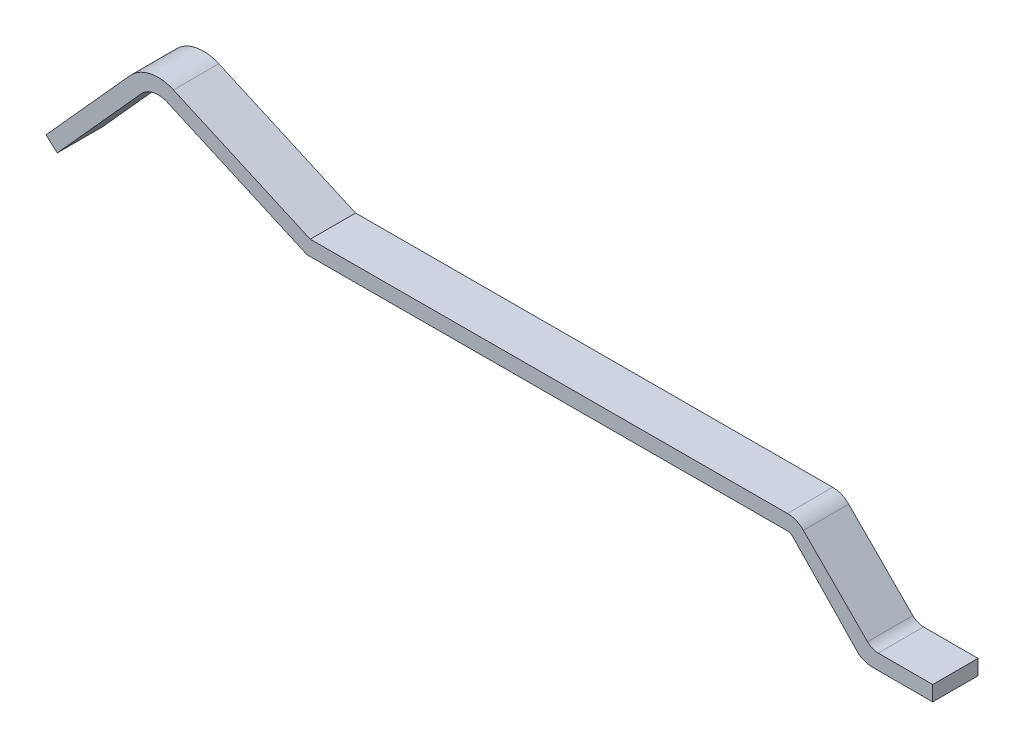
ISO-10303-21;
HEADER;
FILE_DESCRIPTION(('STEP AP214'),'2;1');
FILE_NAME('part.step','',(''),(''),'','','');
FILE_SCHEMA(('AUTOMOTIVE_DESIGN { 1 0 10303 214 1 1 1 1 }'));
ENDSEC;
DATA;
#1=APPLICATION_CONTEXT('core data for automotive mechanical design processes');
#2=APPLICATION_PROTOCOL_DEFINITION('international standard','automotive_design',2000,#1);
#3=PRODUCT_CONTEXT('',#1,'mechanical');
#4=PRODUCT('Part','Part','',(#3));
#5=PRODUCT_RELATED_PRODUCT_CATEGORY('part','',(#4));
#6=PRODUCT_DEFINITION_FORMATION('','',#4);
#7=PRODUCT_DEFINITION_CONTEXT('part definition',#1,'design');
#8=PRODUCT_DEFINITION('design','',#6,#7);
#9=PRODUCT_DEFINITION_SHAPE('','',#8);
#10=(LENGTH_UNIT() NAMED_UNIT(*) SI_UNIT(.MILLI.,.METRE.));
#11=(NAMED_UNIT(*) PLANE_ANGLE_UNIT() SI_UNIT($,.RADIAN.));
#12=(NAMED_UNIT(*) SI_UNIT($,.STERADIAN.) SOLID_ANGLE_UNIT());
#13=UNCERTAINTY_MEASURE_WITH_UNIT(LENGTH_MEASURE(1.E-05),#10,'distance_accuracy_value','');
#14=(GEOMETRIC_REPRESENTATION_CONTEXT(3) GLOBAL_UNCERTAINTY_ASSIGNED_CONTEXT((#13)) GLOBAL_UNIT_ASSIGNED_CONTEXT((#10,
#11,#12)) REPRESENTATION_CONTEXT('',''));
#15=CARTESIAN_POINT('',(0.,0.,0.));
#16=DIRECTION('',(0.,0.,1.));
#17=DIRECTION('',(1.,0.,0.));
#18=AXIS2_PLACEMENT_3D('',#15,#16,#17);
#19=CARTESIAN_POINT('',(19.9707476581065,0.204274436581358,0.3));
#20=DIRECTION('',(0.,-1.,0.));
#21=DIRECTION('',(1.,0.,0.));
#22=AXIS2_PLACEMENT_3D('',#19,#20,#21);
#23=PLANE('',#22);
#24=DIRECTION('',(-1.,0.,0.));
#25=VECTOR('',#24,1.);
#26=CARTESIAN_POINT('',(19.9707476581065,0.204274436581358,-0.3));
#27=LINE('',#26,#25);
#28=CARTESIAN_POINT('',(20.6917527563786,0.204274436581358,-0.3));
#29=VERTEX_POINT('',#28);
#30=CARTESIAN_POINT('',(19.9707476581065,0.204274436581354,-0.3));
#31=VERTEX_POINT('',#30);
#32=EDGE_CURVE('E188',#29,#31,#27,.T.);
#33=ORIENTED_EDGE('',*,*,#32,.T.);
#34=DIRECTION('',(0.,0.,-1.));
#35=VECTOR('',#34,1.);
#36=CARTESIAN_POINT('',(19.9707476581065,0.204274436581354,0.3));
#37=LINE('',#36,#35);
#38=CARTESIAN_POINT('',(19.9707476581065,0.204274436581354,0.3));
#39=VERTEX_POINT('',#38);
#40=EDGE_CURVE('E11',#39,#31,#37,.T.);
#41=ORIENTED_EDGE('',*,*,#40,.F.);
#42=DIRECTION('',(-1.,0.,0.));
#43=VECTOR('',#42,1.);
#44=CARTESIAN_POINT('',(19.9707476581065,0.204274436581358,0.3));
#45=LINE('',#44,#43);
#46=CARTESIAN_POINT('',(20.6917527563786,0.204274436581358,0.3));
#47=VERTEX_POINT('',#46);
#48=EDGE_CURVE('E222',#47,#39,#45,.T.);
#49=ORIENTED_EDGE('',*,*,#48,.F.);
#50=DIRECTION('',(0.,0.,-1.));
#51=VECTOR('',#50,1.);
#52=CARTESIAN_POINT('',(20.6917527563786,0.204274436581358,0.3));
#53=LINE('',#52,#51);
#54=EDGE_CURVE('E184',#47,#29,#53,.T.);
#55=ORIENTED_EDGE('',*,*,#54,.T.);
#56=EDGE_LOOP('',(#33,#41,#49,#55));
#57=FACE_BOUND('',#56,.T.);
#58=ADVANCED_FACE('F32',(#57),#23,.F.);
#59=CARTESIAN_POINT('',(19.9707476581065,0.40427443658135,0.3));
#60=DIRECTION('',(0.,0.,-1.));
#61=DIRECTION('',(-1.,0.,0.));
#62=AXIS2_PLACEMENT_3D('',#59,#60,#61);
#63=CYLINDRICAL_SURFACE('',#62,0.199999999999996);
#64=CARTESIAN_POINT('',(19.9707476581065,0.40427443658135,-0.3));
#65=DIRECTION('',(0.,0.,-1.));
#66=DIRECTION('',(1.,0.,0.));
#67=AXIS2_PLACEMENT_3D('',#64,#65,#66);
#68=CIRCLE('',#67,0.199999999999996);
#69=CARTESIAN_POINT('',(19.8290071205478,0.263172983674001,-0.3));
#70=VERTEX_POINT('',#69);
#71=EDGE_CURVE('E191',#31,#70,#68,.T.);
#72=ORIENTED_EDGE('',*,*,#71,.T.);
#73=DIRECTION('',(0.,0.,-1.));
#74=VECTOR('',#73,1.);
#75=CARTESIAN_POINT('',(19.8290071205478,0.263172983674001,0.3));
#76=LINE('',#75,#74);
#77=CARTESIAN_POINT('',(19.8290071205478,0.263172983674001,0.3));
#78=VERTEX_POINT('',#77);
#79=EDGE_CURVE('E40',#78,#70,#76,.T.);
#80=ORIENTED_EDGE('',*,*,#79,.F.);
#81=CARTESIAN_POINT('',(19.9707476581065,0.40427443658135,0.3));
#82=DIRECTION('',(0.,0.,-1.));
#83=DIRECTION('',(1.,0.,0.));
#84=AXIS2_PLACEMENT_3D('',#81,#82,#83);
#85=CIRCLE('',#84,0.199999999999996);
#86=EDGE_CURVE('E121',#39,#78,#85,.T.);
#87=ORIENTED_EDGE('',*,*,#86,.F.);
#88=ORIENTED_EDGE('',*,*,#40,.T.);
#89=EDGE_LOOP('',(#72,#80,#87,#88));
#90=FACE_BOUND('',#89,.T.);
#91=ADVANCED_FACE('F330',(#90),#63,.F.);
#92=CARTESIAN_POINT('',(18.9796207220227,1.11640647093704,0.3));
#93=DIRECTION('',(-0.708702687793605,-0.705507264536744,0.));
#94=DIRECTION('',(0.705507264536744,-0.708702687793605,0.));
#95=AXIS2_PLACEMENT_3D('',#92,#93,#94);
#96=PLANE('',#95);
#97=DIRECTION('',(-0.705507264536744,0.708702687793606,0.));
#98=VECTOR('',#97,1.);
#99=CARTESIAN_POINT('',(18.9796207220227,1.11640647093704,-0.3));
#100=LINE('',#99,#98);
#101=CARTESIAN_POINT('',(18.9796207220227,1.11640647093706,-0.3));
#102=VERTEX_POINT('',#101);
#103=EDGE_CURVE('E193',#70,#102,#100,.T.);
#104=ORIENTED_EDGE('',*,*,#103,.T.);
#105=DIRECTION('',(0.,0.,-1.));
#106=VECTOR('',#105,1.);
#107=CARTESIAN_POINT('',(18.9796207220227,1.11640647093706,0.3));
#108=LINE('',#107,#106);
#109=CARTESIAN_POINT('',(18.9796207220227,1.11640647093706,0.3));
#110=VERTEX_POINT('',#109);
#111=EDGE_CURVE('E259',#110,#102,#108,.T.);
#112=ORIENTED_EDGE('',*,*,#111,.F.);
#113=DIRECTION('',(-0.705507264536744,0.708702687793606,0.));
#114=VECTOR('',#113,1.);
#115=CARTESIAN_POINT('',(18.9796207220227,1.11640647093704,0.3));
#116=LINE('',#115,#114);
#117=EDGE_CURVE('E267',#78,#110,#116,.T.);
#118=ORIENTED_EDGE('',*,*,#117,.F.);
#119=ORIENTED_EDGE('',*,*,#79,.T.);
#120=EDGE_LOOP('',(#104,#112,#118,#119));
#121=FACE_BOUND('',#120,.T.);
#122=ADVANCED_FACE('F265',(#121),#96,.F.);
#123=CARTESIAN_POINT('',(18.768162863443,0.905902040883409,0.3));
#124=DIRECTION('',(0.,0.,-1.));
#125=DIRECTION('',(-1.,0.,0.));
#126=AXIS2_PLACEMENT_3D('',#123,#124,#125);
#127=CYLINDRICAL_SURFACE('',#126,0.298373157350549);
#128=CARTESIAN_POINT('',(18.768162863443,0.905902040883409,-0.3));
#129=DIRECTION('',(0.,0.,1.));
#130=DIRECTION('',(1.,0.,0.));
#131=AXIS2_PLACEMENT_3D('',#128,#129,#130);
#132=CIRCLE('',#131,0.298373157350549);
#133=CARTESIAN_POINT('',(18.7674886876667,1.20427443658108,-0.3));
#134=VERTEX_POINT('',#133);
#135=EDGE_CURVE('E195',#102,#134,#132,.T.);
#136=ORIENTED_EDGE('',*,*,#135,.T.);
#137=DIRECTION('',(0.,0.,-1.));
#138=VECTOR('',#137,1.);
#139=CARTESIAN_POINT('',(18.7674886876667,1.20427443658108,0.3));
#140=LINE('',#139,#138);
#141=CARTESIAN_POINT('',(18.7674886876667,1.20427443658108,0.3));
#142=VERTEX_POINT('',#141);
#143=EDGE_CURVE('E256',#142,#134,#140,.T.);
#144=ORIENTED_EDGE('',*,*,#143,.F.);
#145=CARTESIAN_POINT('',(18.768162863443,0.905902040883409,0.3));
#146=DIRECTION('',(0.,0.,1.));
#147=DIRECTION('',(1.,0.,0.));
#148=AXIS2_PLACEMENT_3D('',#145,#146,#147);
#149=CIRCLE('',#148,0.298373157350549);
#150=EDGE_CURVE('E285',#110,#142,#149,.T.);
#151=ORIENTED_EDGE('',*,*,#150,.F.);
#152=ORIENTED_EDGE('',*,*,#111,.T.);
#153=EDGE_LOOP('',(#136,#144,#151,#152));
#154=FACE_BOUND('',#153,.T.);
#155=ADVANCED_FACE('F276',(#154),#127,.T.);
#156=CARTESIAN_POINT('',(12.4499999999999,1.19000000000005,0.3));
#157=DIRECTION('',(0.00225950545360753,-0.999997447314295,0.));
#158=DIRECTION('',(0.999997447314295,0.00225950545360753,0.));
#159=AXIS2_PLACEMENT_3D('',#156,#157,#158);
#160=PLANE('',#159);
#161=DIRECTION('',(-0.999997447314294,-0.00225950545360753,0.));
#162=VECTOR('',#161,1.);
#163=CARTESIAN_POINT('',(12.4499999999999,1.19000000000005,-0.3));
#164=LINE('',#163,#162);
#165=CARTESIAN_POINT('',(12.4499999999999,1.19000000000005,-0.3));
#166=VERTEX_POINT('',#165);
#167=EDGE_CURVE('E197',#134,#166,#164,.T.);
#168=ORIENTED_EDGE('',*,*,#167,.T.);
#169=DIRECTION('',(0.,0.,-1.));
#170=VECTOR('',#169,1.);
#171=CARTESIAN_POINT('',(12.4499999999999,1.19000000000005,0.3));
#172=LINE('',#171,#170);
#173=CARTESIAN_POINT('',(12.4499999999999,1.19000000000005,0.3));
#174=VERTEX_POINT('',#173);
#175=EDGE_CURVE('E253',#174,#166,#172,.T.);
#176=ORIENTED_EDGE('',*,*,#175,.F.);
#177=DIRECTION('',(-0.999997447314294,-0.00225950545360753,0.));
#178=VECTOR('',#177,1.);
#179=CARTESIAN_POINT('',(12.4499999999999,1.19000000000005,0.3));
#180=LINE('',#179,#178);
#181=EDGE_CURVE('E282',#142,#174,#180,.T.);
#182=ORIENTED_EDGE('',*,*,#181,.F.);
#183=ORIENTED_EDGE('',*,*,#143,.T.);
#184=EDGE_LOOP('',(#168,#176,#182,#183));
#185=FACE_BOUND('',#184,.T.);
#186=ADVANCED_FACE('F280',(#185),#160,.F.);
#187=CARTESIAN_POINT('',(10.6393188810586,1.9961671740989,0.3));
#188=DIRECTION('',(-0.40673664307565,-0.913545457642668,0.));
#189=DIRECTION('',(0.913545457642668,-0.40673664307565,0.));
#190=AXIS2_PLACEMENT_3D('',#187,#188,#189);
#191=PLANE('',#190);
#192=DIRECTION('',(-0.913545457642668,0.40673664307565,0.));
#193=VECTOR('',#192,1.);
#194=CARTESIAN_POINT('',(10.6393188810586,1.9961671740989,-0.3));
#195=LINE('',#194,#193);
#196=CARTESIAN_POINT('',(10.6393188810586,1.9961671740989,-0.3));
#197=VERTEX_POINT('',#196);
#198=EDGE_CURVE('E199',#166,#197,#195,.T.);
#199=ORIENTED_EDGE('',*,*,#198,.T.);
#200=DIRECTION('',(0.,0.,-1.));
#201=VECTOR('',#200,1.);
#202=CARTESIAN_POINT('',(10.6393188810586,1.9961671740989,0.3));
#203=LINE('',#202,#201);
#204=CARTESIAN_POINT('',(10.6393188810586,1.9961671740989,0.3));
#205=VERTEX_POINT('',#204);
#206=EDGE_CURVE('E250',#205,#197,#203,.T.);
#207=ORIENTED_EDGE('',*,*,#206,.F.);
#208=DIRECTION('',(-0.913545457642668,0.40673664307565,0.));
#209=VECTOR('',#208,1.);
#210=CARTESIAN_POINT('',(10.6393188810586,1.9961671740989,0.3));
#211=LINE('',#210,#209);
#212=EDGE_CURVE('E284',#174,#205,#211,.T.);
#213=ORIENTED_EDGE('',*,*,#212,.F.);
#214=ORIENTED_EDGE('',*,*,#175,.T.);
#215=EDGE_LOOP('',(#199,#207,#213,#214));
#216=FACE_BOUND('',#215,.T.);
#217=ADVANCED_FACE('F343',(#216),#191,.F.);
#218=CARTESIAN_POINT('',(10.4359505595208,1.53939444527736,0.3));
#219=DIRECTION('',(0.,0.,-1.));
#220=DIRECTION('',(-1.,0.,0.));
#221=AXIS2_PLACEMENT_3D('',#218,#219,#220);
#222=CYLINDRICAL_SURFACE('',#221,0.50000000000019);
#223=CARTESIAN_POINT('',(10.4359505595208,1.53939444527736,-0.3));
#224=DIRECTION('',(0.,0.,1.));
#225=DIRECTION('',(1.,0.,0.));
#226=AXIS2_PLACEMENT_3D('',#223,#224,#225);
#227=CIRCLE('',#226,0.50000000000019);
#228=CARTESIAN_POINT('',(10.0643781467819,1.87395974845692,-0.3));
#229=VERTEX_POINT('',#228);
#230=EDGE_CURVE('E201',#197,#229,#227,.T.);
#231=ORIENTED_EDGE('',*,*,#230,.T.);
#232=DIRECTION('',(0.,0.,-1.));
#233=VECTOR('',#232,1.);
#234=CARTESIAN_POINT('',(10.0643781467819,1.87395974845692,0.3));
#235=LINE('',#234,#233);
#236=CARTESIAN_POINT('',(10.0643781467819,1.87395974845692,0.3));
#237=VERTEX_POINT('',#236);
#238=EDGE_CURVE('E247',#237,#229,#235,.T.);
#239=ORIENTED_EDGE('',*,*,#238,.F.);
#240=CARTESIAN_POINT('',(10.4359505595208,1.53939444527736,0.3));
#241=DIRECTION('',(0.,0.,1.));
#242=DIRECTION('',(1.,0.,0.));
#243=AXIS2_PLACEMENT_3D('',#240,#241,#242);
#244=CIRCLE('',#243,0.50000000000019);
#245=EDGE_CURVE('E287',#205,#237,#244,.T.);
#246=ORIENTED_EDGE('',*,*,#245,.F.);
#247=ORIENTED_EDGE('',*,*,#206,.T.);
#248=EDGE_LOOP('',(#231,#239,#246,#247));
#249=FACE_BOUND('',#248,.T.);
#250=ADVANCED_FACE('F346',(#249),#222,.T.);
#251=CARTESIAN_POINT('',(8.95090286046869,0.63732016052452,0.3));
#252=DIRECTION('',(0.743144825477361,-0.669130606358895,0.));
#253=DIRECTION('',(0.669130606358895,0.743144825477361,0.));
#254=AXIS2_PLACEMENT_3D('',#251,#252,#253);
#255=PLANE('',#254);
#256=DIRECTION('',(-0.669130606358895,-0.743144825477361,0.));
#257=VECTOR('',#256,1.);
#258=CARTESIAN_POINT('',(8.95090286046869,0.63732016052452,-0.3));
#259=LINE('',#258,#257);
#260=CARTESIAN_POINT('',(8.95090286046869,0.63732016052452,-0.3));
#261=VERTEX_POINT('',#260);
#262=EDGE_CURVE('E203',#229,#261,#259,.T.);
#263=ORIENTED_EDGE('',*,*,#262,.T.);
#264=DIRECTION('',(0.,0.,-1.));
#265=VECTOR('',#264,1.);
#266=CARTESIAN_POINT('',(8.95090286046869,0.63732016052452,0.3));
#267=LINE('',#266,#265);
#268=CARTESIAN_POINT('',(8.95090286046869,0.63732016052452,0.3));
#269=VERTEX_POINT('',#268);
#270=EDGE_CURVE('E244',#269,#261,#267,.T.);
#271=ORIENTED_EDGE('',*,*,#270,.F.);
#272=DIRECTION('',(-0.669130606358895,-0.743144825477361,0.));
#273=VECTOR('',#272,1.);
#274=CARTESIAN_POINT('',(8.95090286046869,0.63732016052452,0.3));
#275=LINE('',#274,#273);
#276=EDGE_CURVE('E293',#237,#269,#275,.T.);
#277=ORIENTED_EDGE('',*,*,#276,.F.);
#278=ORIENTED_EDGE('',*,*,#238,.T.);
#279=EDGE_LOOP('',(#263,#271,#277,#278));
#280=FACE_BOUND('',#279,.T.);
#281=ADVANCED_FACE('F350',(#280),#255,.F.);
#282=CARTESIAN_POINT('',(9.09953182556442,0.503494039252559,0.3));
#283=DIRECTION('',(0.669130606358746,0.743144825477495,0.));
#284=DIRECTION('',(-0.743144825477495,0.669130606358746,0.));
#285=AXIS2_PLACEMENT_3D('',#282,#283,#284);
#286=PLANE('',#285);
#287=DIRECTION('',(0.743144825477495,-0.669130606358746,0.));
#288=VECTOR('',#287,1.);
#289=CARTESIAN_POINT('',(9.09953182556442,0.503494039252559,-0.3));
#290=LINE('',#289,#288);
#291=CARTESIAN_POINT('',(9.09953182556442,0.503494039252559,-0.3));
#292=VERTEX_POINT('',#291);
#293=EDGE_CURVE('E205',#261,#292,#290,.T.);
#294=ORIENTED_EDGE('',*,*,#293,.T.);
#295=DIRECTION('',(0.,0.,-1.));
#296=VECTOR('',#295,1.);
#297=CARTESIAN_POINT('',(9.09953182556442,0.503494039252559,0.3));
#298=LINE('',#297,#296);
#299=CARTESIAN_POINT('',(9.09953182556442,0.503494039252559,0.3));
#300=VERTEX_POINT('',#299);
#301=EDGE_CURVE('E241',#300,#292,#298,.T.);
#302=ORIENTED_EDGE('',*,*,#301,.F.);
#303=DIRECTION('',(0.743144825477495,-0.669130606358746,0.));
#304=VECTOR('',#303,1.);
#305=CARTESIAN_POINT('',(9.09953182556442,0.503494039252559,0.3));
#306=LINE('',#305,#304);
#307=EDGE_CURVE('E295',#269,#300,#306,.T.);
#308=ORIENTED_EDGE('',*,*,#307,.F.);
#309=ORIENTED_EDGE('',*,*,#270,.T.);
#310=EDGE_LOOP('',(#294,#302,#308,#309));
#311=FACE_BOUND('',#310,.T.);
#312=ADVANCED_FACE('F354',(#311),#286,.F.);
#313=CARTESIAN_POINT('',(10.2130071118774,1.74013362718514,0.3));
#314=DIRECTION('',(-0.743144825477495,0.669130606358746,0.));
#315=DIRECTION('',(-0.669130606358746,-0.743144825477495,0.));
#316=AXIS2_PLACEMENT_3D('',#313,#314,#315);
#317=PLANE('',#316);
#318=DIRECTION('',(0.669130606358746,0.743144825477495,0.));
#319=VECTOR('',#318,1.);
#320=CARTESIAN_POINT('',(10.2130071118774,1.74013362718514,-0.3));
#321=LINE('',#320,#319);
#322=CARTESIAN_POINT('',(10.2130071118774,1.74013362718514,-0.3));
#323=VERTEX_POINT('',#322);
#324=EDGE_CURVE('E207',#292,#323,#321,.T.);
#325=ORIENTED_EDGE('',*,*,#324,.T.);
#326=DIRECTION('',(0.,0.,-1.));
#327=VECTOR('',#326,1.);
#328=CARTESIAN_POINT('',(10.2130071118774,1.74013362718514,0.3));
#329=LINE('',#328,#327);
#330=CARTESIAN_POINT('',(10.2130071118774,1.74013362718514,0.3));
#331=VERTEX_POINT('',#330);
#332=EDGE_CURVE('E238',#331,#323,#329,.T.);
#333=ORIENTED_EDGE('',*,*,#332,.F.);
#334=DIRECTION('',(0.669130606358746,0.743144825477495,0.));
#335=VECTOR('',#334,1.);
#336=CARTESIAN_POINT('',(10.2130071118774,1.74013362718514,0.3));
#337=LINE('',#336,#335);
#338=EDGE_CURVE('E297',#300,#331,#337,.T.);
#339=ORIENTED_EDGE('',*,*,#338,.F.);
#340=ORIENTED_EDGE('',*,*,#301,.T.);
#341=EDGE_LOOP('',(#325,#333,#339,#340));
#342=FACE_BOUND('',#341,.T.);
#343=ADVANCED_FACE('F358',(#342),#317,.F.);
#344=CARTESIAN_POINT('',(10.4359505595208,1.53939444527741,0.3));
#345=DIRECTION('',(0.,0.,-1.));
#346=DIRECTION('',(-1.,0.,0.));
#347=AXIS2_PLACEMENT_3D('',#344,#345,#346);
#348=CYLINDRICAL_SURFACE('',#347,0.300000000000162);
#349=CARTESIAN_POINT('',(10.4359505595208,1.53939444527741,-0.3));
#350=DIRECTION('',(0.,0.,-1.));
#351=DIRECTION('',(1.,0.,0.));
#352=AXIS2_PLACEMENT_3D('',#349,#350,#351);
#353=CIRCLE('',#352,0.300000000000162);
#354=CARTESIAN_POINT('',(10.5579715524435,1.81345808257036,-0.3));
#355=VERTEX_POINT('',#354);
#356=EDGE_CURVE('E209',#323,#355,#353,.T.);
#357=ORIENTED_EDGE('',*,*,#356,.T.);
#358=DIRECTION('',(0.,0.,-1.));
#359=VECTOR('',#358,1.);
#360=CARTESIAN_POINT('',(10.5579715524435,1.81345808257036,0.3));
#361=LINE('',#360,#359);
#362=CARTESIAN_POINT('',(10.5579715524435,1.81345808257036,0.3));
#363=VERTEX_POINT('',#362);
#364=EDGE_CURVE('E235',#363,#355,#361,.T.);
#365=ORIENTED_EDGE('',*,*,#364,.F.);
#366=CARTESIAN_POINT('',(10.4359505595208,1.53939444527741,0.3));
#367=DIRECTION('',(0.,0.,-1.));
#368=DIRECTION('',(1.,0.,0.));
#369=AXIS2_PLACEMENT_3D('',#366,#367,#368);
#370=CIRCLE('',#369,0.300000000000162);
#371=EDGE_CURVE('E299',#331,#363,#370,.T.);
#372=ORIENTED_EDGE('',*,*,#371,.F.);
#373=ORIENTED_EDGE('',*,*,#332,.T.);
#374=EDGE_LOOP('',(#357,#365,#372,#373));
#375=FACE_BOUND('',#374,.T.);
#376=ADVANCED_FACE('F362',(#375),#348,.F.);
#377=CARTESIAN_POINT('',(12.407488687666,0.99,0.3));
#378=DIRECTION('',(0.40673664307565,0.913545457642667,0.));
#379=DIRECTION('',(-0.913545457642668,0.40673664307565,0.));
#380=AXIS2_PLACEMENT_3D('',#377,#378,#379);
#381=PLANE('',#380);
#382=DIRECTION('',(0.913545457642668,-0.40673664307565,0.));
#383=VECTOR('',#382,1.);
#384=CARTESIAN_POINT('',(12.407488687666,0.99,-0.3));
#385=LINE('',#384,#383);
#386=CARTESIAN_POINT('',(12.407488687666,0.99,-0.3));
#387=VERTEX_POINT('',#386);
#388=EDGE_CURVE('E211',#355,#387,#385,.T.);
#389=ORIENTED_EDGE('',*,*,#388,.T.);
#390=DIRECTION('',(0.,0.,-1.));
#391=VECTOR('',#390,1.);
#392=CARTESIAN_POINT('',(12.407488687666,0.99,0.3));
#393=LINE('',#392,#391);
#394=CARTESIAN_POINT('',(12.407488687666,0.99,0.3));
#395=VERTEX_POINT('',#394);
#396=EDGE_CURVE('E232',#395,#387,#393,.T.);
#397=ORIENTED_EDGE('',*,*,#396,.F.);
#398=DIRECTION('',(0.913545457642668,-0.40673664307565,0.));
#399=VECTOR('',#398,1.);
#400=CARTESIAN_POINT('',(12.407488687666,0.99,0.3));
#401=LINE('',#400,#399);
#402=EDGE_CURVE('E301',#363,#395,#401,.T.);
#403=ORIENTED_EDGE('',*,*,#402,.F.);
#404=ORIENTED_EDGE('',*,*,#364,.T.);
#405=EDGE_LOOP('',(#389,#397,#403,#404));
#406=FACE_BOUND('',#405,.T.);
#407=ADVANCED_FACE('F366',(#406),#381,.F.);
#408=CARTESIAN_POINT('',(18.767488687666,1.00437049136829,0.3));
#409=DIRECTION('',(-0.00225950545360761,0.999997447314294,0.));
#410=DIRECTION('',(-0.999997447314295,-0.00225950545360761,0.));
#411=AXIS2_PLACEMENT_3D('',#408,#409,#410);
#412=PLANE('',#411);
#413=DIRECTION('',(0.999997447314295,0.00225950545360761,0.));
#414=VECTOR('',#413,1.);
#415=CARTESIAN_POINT('',(18.767488687666,1.00437049136829,-0.3));
#416=LINE('',#415,#414);
#417=CARTESIAN_POINT('',(18.767488687666,1.00437049136827,-0.3));
#418=VERTEX_POINT('',#417);
#419=EDGE_CURVE('E213',#387,#418,#416,.T.);
#420=ORIENTED_EDGE('',*,*,#419,.T.);
#421=DIRECTION('',(0.,0.,-1.));
#422=VECTOR('',#421,1.);
#423=CARTESIAN_POINT('',(18.767488687666,1.00437049136827,0.3));
#424=LINE('',#423,#422);
#425=CARTESIAN_POINT('',(18.767488687666,1.00437049136827,0.3));
#426=VERTEX_POINT('',#425);
#427=EDGE_CURVE('E229',#426,#418,#424,.T.);
#428=ORIENTED_EDGE('',*,*,#427,.F.);
#429=DIRECTION('',(0.999997447314295,0.00225950545360761,0.));
#430=VECTOR('',#429,1.);
#431=CARTESIAN_POINT('',(18.767488687666,1.00437049136829,0.3));
#432=LINE('',#431,#430);
#433=EDGE_CURVE('E303',#395,#426,#432,.T.);
#434=ORIENTED_EDGE('',*,*,#433,.F.);
#435=ORIENTED_EDGE('',*,*,#396,.T.);
#436=EDGE_LOOP('',(#420,#428,#434,#435));
#437=FACE_BOUND('',#436,.T.);
#438=ADVANCED_FACE('F370',(#437),#412,.F.);
#439=CARTESIAN_POINT('',(18.7677134245142,0.904907896956171,0.3));
#440=DIRECTION('',(0.,0.,-1.));
#441=DIRECTION('',(-1.,0.,0.));
#442=AXIS2_PLACEMENT_3D('',#439,#440,#441);
#443=CYLINDRICAL_SURFACE('',#442,0.0994628483094918);
#444=CARTESIAN_POINT('',(18.7677134245142,0.904907896956171,-0.3));
#445=DIRECTION('',(0.,0.,-1.));
#446=DIRECTION('',(-1.,0.,0.));
#447=AXIS2_PLACEMENT_3D('',#444,#445,#446);
#448=CIRCLE('',#447,0.0994628483094918);
#449=CARTESIAN_POINT('',(18.8381993657854,0.975083321977687,-0.3));
#450=VERTEX_POINT('',#449);
#451=EDGE_CURVE('E215',#418,#450,#448,.T.);
#452=ORIENTED_EDGE('',*,*,#451,.T.);
#453=DIRECTION('',(0.,0.,-1.));
#454=VECTOR('',#453,1.);
#455=CARTESIAN_POINT('',(18.8381993657854,0.975083321977687,0.3));
#456=LINE('',#455,#454);
#457=CARTESIAN_POINT('',(18.8381993657854,0.975083321977687,0.3));
#458=VERTEX_POINT('',#457);
#459=EDGE_CURVE('E226',#458,#450,#456,.T.);
#460=ORIENTED_EDGE('',*,*,#459,.F.);
#461=CARTESIAN_POINT('',(18.7677134245142,0.904907896956171,0.3));
#462=DIRECTION('',(0.,0.,-1.));
#463=DIRECTION('',(-1.,0.,0.));
#464=AXIS2_PLACEMENT_3D('',#461,#462,#463);
#465=CIRCLE('',#464,0.0994628483094918);
#466=EDGE_CURVE('E305',#426,#458,#465,.T.);
#467=ORIENTED_EDGE('',*,*,#466,.F.);
#468=ORIENTED_EDGE('',*,*,#427,.T.);
#469=EDGE_LOOP('',(#452,#460,#467,#468));
#470=FACE_BOUND('',#469,.T.);
#471=ADVANCED_FACE('F311',(#470),#443,.F.);
#472=CARTESIAN_POINT('',(19.7117527563786,0.0642744365812144,0.3));
#473=DIRECTION('',(0.721713092096621,0.692192323488447,0.));
#474=DIRECTION('',(-0.692192323488447,0.721713092096621,0.));
#475=AXIS2_PLACEMENT_3D('',#472,#473,#474);
#476=PLANE('',#475);
#477=DIRECTION('',(0.692192323488447,-0.72171309209662,0.));
#478=VECTOR('',#477,1.);
#479=CARTESIAN_POINT('',(19.7117527563786,0.0642744365812144,-0.3));
#480=LINE('',#479,#478);
#481=CARTESIAN_POINT('',(19.7117527563786,0.0642744365812143,-0.3));
#482=VERTEX_POINT('',#481);
#483=EDGE_CURVE('E217',#450,#482,#480,.T.);
#484=ORIENTED_EDGE('',*,*,#483,.T.);
#485=DIRECTION('',(0.,0.,-1.));
#486=VECTOR('',#485,1.);
#487=CARTESIAN_POINT('',(19.7117527563786,0.0642744365812143,0.3));
#488=LINE('',#487,#486);
#489=CARTESIAN_POINT('',(19.7117527563786,0.0642744365812143,0.3));
#490=VERTEX_POINT('',#489);
#491=EDGE_CURVE('E179',#490,#482,#488,.T.);
#492=ORIENTED_EDGE('',*,*,#491,.F.);
#493=DIRECTION('',(0.692192323488447,-0.72171309209662,0.));
#494=VECTOR('',#493,1.);
#495=CARTESIAN_POINT('',(19.7117527563786,0.0642744365812144,0.3));
#496=LINE('',#495,#494);
#497=EDGE_CURVE('E170',#458,#490,#496,.T.);
#498=ORIENTED_EDGE('',*,*,#497,.F.);
#499=ORIENTED_EDGE('',*,*,#459,.T.);
#500=EDGE_LOOP('',(#484,#492,#498,#499));
#501=FACE_BOUND('',#500,.T.);
#502=ADVANCED_FACE('F315',(#501),#476,.F.);
#503=CARTESIAN_POINT('',(19.8917527563786,0.304274436581662,0.3));
#504=DIRECTION('',(0.,0.,-1.));
#505=DIRECTION('',(-1.,0.,0.));
#506=AXIS2_PLACEMENT_3D('',#503,#504,#505);
#507=CYLINDRICAL_SURFACE('',#506,0.300000000000358);
#508=CARTESIAN_POINT('',(19.8917527563786,0.304274436581662,-0.3));
#509=DIRECTION('',(0.,0.,1.));
#510=DIRECTION('',(-1.,0.,0.));
#511=AXIS2_PLACEMENT_3D('',#508,#509,#510);
#512=CIRCLE('',#511,0.300000000000358);
#513=CARTESIAN_POINT('',(19.8917527563786,0.00427443658130414,-0.3));
#514=VERTEX_POINT('',#513);
#515=EDGE_CURVE('E178',#482,#514,#512,.T.);
#516=ORIENTED_EDGE('',*,*,#515,.T.);
#517=DIRECTION('',(0.,0.,-1.));
#518=VECTOR('',#517,1.);
#519=CARTESIAN_POINT('',(19.8917527563786,0.00427443658130414,0.3));
#520=LINE('',#519,#518);
#521=CARTESIAN_POINT('',(19.8917527563786,0.00427443658130414,0.3));
#522=VERTEX_POINT('',#521);
#523=EDGE_CURVE('E175',#522,#514,#520,.T.);
#524=ORIENTED_EDGE('',*,*,#523,.F.);
#525=CARTESIAN_POINT('',(19.8917527563786,0.304274436581662,0.3));
#526=DIRECTION('',(0.,0.,1.));
#527=DIRECTION('',(-1.,0.,0.));
#528=AXIS2_PLACEMENT_3D('',#525,#526,#527);
#529=CIRCLE('',#528,0.300000000000358);
#530=EDGE_CURVE('E164',#490,#522,#529,.T.);
#531=ORIENTED_EDGE('',*,*,#530,.F.);
#532=ORIENTED_EDGE('',*,*,#491,.T.);
#533=EDGE_LOOP('',(#516,#524,#531,#532));
#534=FACE_BOUND('',#533,.T.);
#535=ADVANCED_FACE('F176',(#534),#507,.T.);
#536=CARTESIAN_POINT('',(20.6917527563786,0.00427443658130424,0.3));
#537=DIRECTION('',(0.,1.,0.));
#538=DIRECTION('',(-1.,0.,0.));
#539=AXIS2_PLACEMENT_3D('',#536,#537,#538);
#540=PLANE('',#539);
#541=DIRECTION('',(1.,0.,0.));
#542=VECTOR('',#541,1.);
#543=CARTESIAN_POINT('',(20.6917527563786,0.00427443658130424,-0.3));
#544=LINE('',#543,#542);
#545=CARTESIAN_POINT('',(20.6917527563786,0.00427443658130424,-0.3));
#546=VERTEX_POINT('',#545);
#547=EDGE_CURVE('E107',#514,#546,#544,.T.);
#548=ORIENTED_EDGE('',*,*,#547,.T.);
#549=DIRECTION('',(0.,0.,-1.));
#550=VECTOR('',#549,1.);
#551=CARTESIAN_POINT('',(20.6917527563786,0.00427443658130424,0.3));
#552=LINE('',#551,#550);
#553=CARTESIAN_POINT('',(20.6917527563786,0.00427443658130424,0.3));
#554=VERTEX_POINT('',#553);
#555=EDGE_CURVE('E180',#554,#546,#552,.T.);
#556=ORIENTED_EDGE('',*,*,#555,.F.);
#557=DIRECTION('',(1.,0.,0.));
#558=VECTOR('',#557,1.);
#559=CARTESIAN_POINT('',(20.6917527563786,0.00427443658130424,0.3));
#560=LINE('',#559,#558);
#561=EDGE_CURVE('E168',#522,#554,#560,.T.);
#562=ORIENTED_EDGE('',*,*,#561,.F.);
#563=ORIENTED_EDGE('',*,*,#523,.T.);
#564=EDGE_LOOP('',(#548,#556,#562,#563));
#565=FACE_BOUND('',#564,.T.);
#566=ADVANCED_FACE('F182',(#565),#540,.F.);
#567=CARTESIAN_POINT('',(20.6917527563786,0.204274436581358,0.3));
#568=DIRECTION('',(-1.,0.,0.));
#569=DIRECTION('',(0.,0.,1.));
#570=AXIS2_PLACEMENT_3D('',#567,#568,#569);
#571=PLANE('',#570);
#572=DIRECTION('',(0.,1.,0.));
#573=VECTOR('',#572,1.);
#574=CARTESIAN_POINT('',(20.6917527563786,0.204274436581358,-0.3));
#575=LINE('',#574,#573);
#576=EDGE_CURVE('E113',#546,#29,#575,.T.);
#577=ORIENTED_EDGE('',*,*,#576,.T.);
#578=ORIENTED_EDGE('',*,*,#54,.F.);
#579=DIRECTION('',(0.,1.,0.));
#580=VECTOR('',#579,1.);
#581=CARTESIAN_POINT('',(20.6917527563786,0.204274436581358,0.3));
#582=LINE('',#581,#580);
#583=EDGE_CURVE('E48',#554,#47,#582,.T.);
#584=ORIENTED_EDGE('',*,*,#583,.F.);
#585=ORIENTED_EDGE('',*,*,#555,.T.);
#586=EDGE_LOOP('',(#577,#578,#584,#585));
#587=FACE_BOUND('',#586,.T.);
#588=ADVANCED_FACE('F319',(#587),#571,.F.);
#589=CARTESIAN_POINT('',(19.8917527563786,0.304274436581662,0.3));
#590=DIRECTION('',(0.,0.,-1.));
#591=DIRECTION('',(-1.,0.,0.));
#592=AXIS2_PLACEMENT_3D('',#589,#590,#591);
#593=PLANE('',#592);
#594=ORIENTED_EDGE('',*,*,#48,.T.);
#595=ORIENTED_EDGE('',*,*,#86,.T.);
#596=ORIENTED_EDGE('',*,*,#117,.T.);
#597=ORIENTED_EDGE('',*,*,#150,.T.);
#598=ORIENTED_EDGE('',*,*,#181,.T.);
#599=ORIENTED_EDGE('',*,*,#212,.T.);
#600=ORIENTED_EDGE('',*,*,#245,.T.);
#601=ORIENTED_EDGE('',*,*,#276,.T.);
#602=ORIENTED_EDGE('',*,*,#307,.T.);
#603=ORIENTED_EDGE('',*,*,#338,.T.);
#604=ORIENTED_EDGE('',*,*,#371,.T.);
#605=ORIENTED_EDGE('',*,*,#402,.T.);
#606=ORIENTED_EDGE('',*,*,#433,.T.);
#607=ORIENTED_EDGE('',*,*,#466,.T.);
#608=ORIENTED_EDGE('',*,*,#497,.T.);
#609=ORIENTED_EDGE('',*,*,#530,.T.);
#610=ORIENTED_EDGE('',*,*,#561,.T.);
#611=ORIENTED_EDGE('',*,*,#583,.T.);
#612=EDGE_LOOP('',(#594,#595,#596,#597,#598,#599,#600,#601,#602,#603,#604,#605,#606,#607,#608,
#609,#610,#611));
#613=FACE_BOUND('',#612,.T.);
#614=ADVANCED_FACE('F166',(#613),#593,.F.);
#615=CARTESIAN_POINT('',(19.8917527563786,0.304274436581662,-0.3));
#616=DIRECTION('',(0.,0.,-1.));
#617=DIRECTION('',(-1.,0.,0.));
#618=AXIS2_PLACEMENT_3D('',#615,#616,#617);
#619=PLANE('',#618);
#620=ORIENTED_EDGE('',*,*,#32,.F.);
#621=ORIENTED_EDGE('',*,*,#576,.F.);
#622=ORIENTED_EDGE('',*,*,#547,.F.);
#623=ORIENTED_EDGE('',*,*,#515,.F.);
#624=ORIENTED_EDGE('',*,*,#483,.F.);
#625=ORIENTED_EDGE('',*,*,#451,.F.);
#626=ORIENTED_EDGE('',*,*,#419,.F.);
#627=ORIENTED_EDGE('',*,*,#388,.F.);
#628=ORIENTED_EDGE('',*,*,#356,.F.);
#629=ORIENTED_EDGE('',*,*,#324,.F.);
#630=ORIENTED_EDGE('',*,*,#293,.F.);
#631=ORIENTED_EDGE('',*,*,#262,.F.);
#632=ORIENTED_EDGE('',*,*,#230,.F.);
#633=ORIENTED_EDGE('',*,*,#198,.F.);
#634=ORIENTED_EDGE('',*,*,#167,.F.);
#635=ORIENTED_EDGE('',*,*,#135,.F.);
#636=ORIENTED_EDGE('',*,*,#103,.F.);
#637=ORIENTED_EDGE('',*,*,#71,.F.);
#638=EDGE_LOOP('',(#620,#621,#622,#623,#624,#625,#626,#627,#628,#629,#630,#631,#632,#633,#634,
#635,#636,#637));
#639=FACE_BOUND('',#638,.T.);
#640=ADVANCED_FACE('F271',(#639),#619,.T.);
#641=CLOSED_SHELL('',(#58,#91,#122,#155,#186,#217,#250,#281,#312,#343,#376,#407,#438,#471,#502,
#535,#566,#588,#614,#640));
#642=MANIFOLD_SOLID_BREP('B2',#641);
#643=ADVANCED_BREP_SHAPE_REPRESENTATION('',(#18,#642),#14);
#644=SHAPE_DEFINITION_REPRESENTATION(#9,#643);
ENDSEC;
END-ISO-10303-21;
